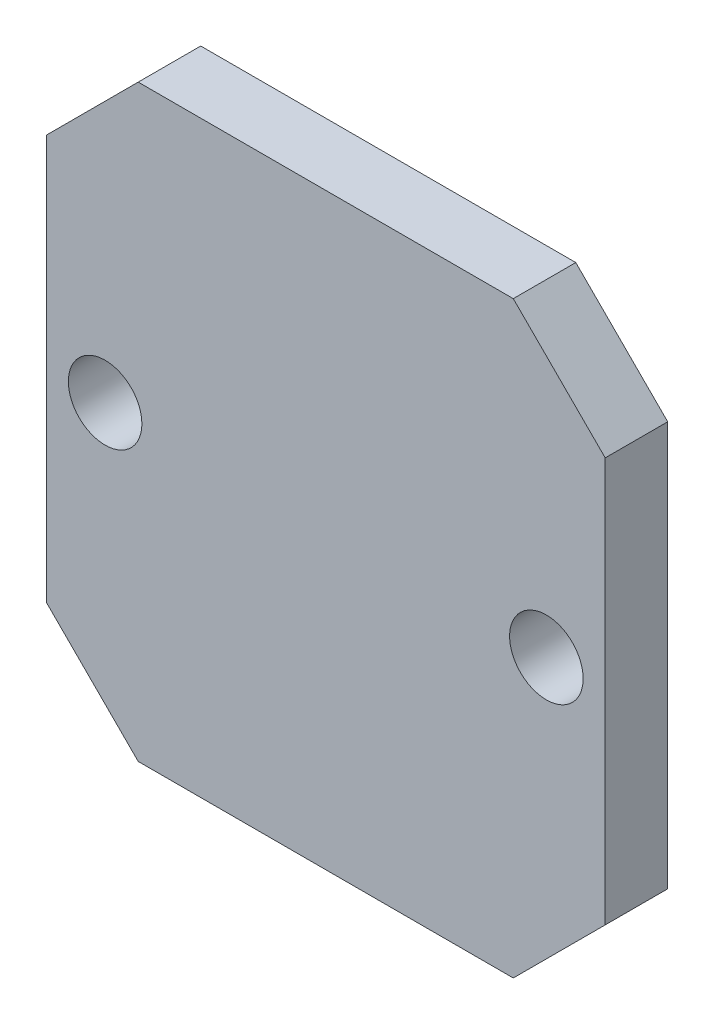
ISO-10303-21;
HEADER;
FILE_DESCRIPTION(('STEP AP214'),'2;1');
FILE_NAME('part.step','',(''),(''),'','','');
FILE_SCHEMA(('AUTOMOTIVE_DESIGN { 1 0 10303 214 1 1 1 1 }'));
ENDSEC;
DATA;
#1=APPLICATION_CONTEXT('core data for automotive mechanical design processes');
#2=APPLICATION_PROTOCOL_DEFINITION('international standard','automotive_design',2000,#1);
#3=PRODUCT_CONTEXT('',#1,'mechanical');
#4=PRODUCT('Part','Part','',(#3));
#5=PRODUCT_RELATED_PRODUCT_CATEGORY('part','',(#4));
#6=PRODUCT_DEFINITION_FORMATION('','',#4);
#7=PRODUCT_DEFINITION_CONTEXT('part definition',#1,'design');
#8=PRODUCT_DEFINITION('design','',#6,#7);
#9=PRODUCT_DEFINITION_SHAPE('','',#8);
#10=(LENGTH_UNIT() NAMED_UNIT(*) SI_UNIT(.MILLI.,.METRE.));
#11=(NAMED_UNIT(*) PLANE_ANGLE_UNIT() SI_UNIT($,.RADIAN.));
#12=(NAMED_UNIT(*) SI_UNIT($,.STERADIAN.) SOLID_ANGLE_UNIT());
#13=UNCERTAINTY_MEASURE_WITH_UNIT(LENGTH_MEASURE(1.E-05),#10,'distance_accuracy_value','');
#14=(GEOMETRIC_REPRESENTATION_CONTEXT(3) GLOBAL_UNCERTAINTY_ASSIGNED_CONTEXT((#13)) GLOBAL_UNIT_ASSIGNED_CONTEXT((#10,
#11,#12)) REPRESENTATION_CONTEXT('',''));
#15=CARTESIAN_POINT('',(0.,0.,0.));
#16=DIRECTION('',(0.,0.,1.));
#17=DIRECTION('',(1.,0.,0.));
#18=AXIS2_PLACEMENT_3D('',#15,#16,#17);
#19=CARTESIAN_POINT('',(0.,0.,1.7));
#20=DIRECTION('',(0.,0.,-1.));
#21=DIRECTION('',(-1.,0.,0.));
#22=AXIS2_PLACEMENT_3D('',#19,#20,#21);
#23=PLANE('',#22);
#24=DIRECTION('',(1.,0.,0.));
#25=VECTOR('',#24,1.);
#26=CARTESIAN_POINT('',(7.6,-8.,1.7));
#27=LINE('',#26,#25);
#28=CARTESIAN_POINT('',(-5.1,-8.,1.7));
#29=VERTEX_POINT('',#28);
#30=CARTESIAN_POINT('',(5.09999999999999,-8.,1.7));
#31=VERTEX_POINT('',#30);
#32=EDGE_CURVE('E168',#29,#31,#27,.T.);
#33=ORIENTED_EDGE('',*,*,#32,.T.);
#34=DIRECTION('',(-0.707106781186549,-0.707106781186546,0.));
#35=VECTOR('',#34,1.);
#36=CARTESIAN_POINT('',(7.6,-5.5,1.7));
#37=LINE('',#36,#35);
#38=CARTESIAN_POINT('',(7.6,-5.5,1.7));
#39=VERTEX_POINT('',#38);
#40=EDGE_CURVE('E148',#31,#39,#37,.F.);
#41=ORIENTED_EDGE('',*,*,#40,.T.);
#42=DIRECTION('',(0.,1.,0.));
#43=VECTOR('',#42,1.);
#44=CARTESIAN_POINT('',(7.6,8.,1.7));
#45=LINE('',#44,#43);
#46=CARTESIAN_POINT('',(7.6,5.49999999999999,1.7));
#47=VERTEX_POINT('',#46);
#48=EDGE_CURVE('E118',#39,#47,#45,.T.);
#49=ORIENTED_EDGE('',*,*,#48,.T.);
#50=DIRECTION('',(0.707106781186546,-0.707106781186549,0.));
#51=VECTOR('',#50,1.);
#52=CARTESIAN_POINT('',(5.1,8.,1.7));
#53=LINE('',#52,#51);
#54=CARTESIAN_POINT('',(5.1,8.,1.7));
#55=VERTEX_POINT('',#54);
#56=EDGE_CURVE('E54',#47,#55,#53,.F.);
#57=ORIENTED_EDGE('',*,*,#56,.T.);
#58=DIRECTION('',(-1.,0.,0.));
#59=VECTOR('',#58,1.);
#60=CARTESIAN_POINT('',(7.6,8.,1.7));
#61=LINE('',#60,#59);
#62=CARTESIAN_POINT('',(-5.09999999999999,8.,1.7));
#63=VERTEX_POINT('',#62);
#64=EDGE_CURVE('E135',#55,#63,#61,.T.);
#65=ORIENTED_EDGE('',*,*,#64,.T.);
#66=DIRECTION('',(0.707106781186549,0.707106781186546,0.));
#67=VECTOR('',#66,1.);
#68=CARTESIAN_POINT('',(-7.6,5.5,1.7));
#69=LINE('',#68,#67);
#70=CARTESIAN_POINT('',(-7.6,5.5,1.7));
#71=VERTEX_POINT('',#70);
#72=EDGE_CURVE('E143',#63,#71,#69,.F.);
#73=ORIENTED_EDGE('',*,*,#72,.T.);
#74=DIRECTION('',(0.,-1.,0.));
#75=VECTOR('',#74,1.);
#76=CARTESIAN_POINT('',(-7.6,8.,1.7));
#77=LINE('',#76,#75);
#78=CARTESIAN_POINT('',(-7.6,-5.49999999999999,1.7));
#79=VERTEX_POINT('',#78);
#80=EDGE_CURVE('E129',#71,#79,#77,.T.);
#81=ORIENTED_EDGE('',*,*,#80,.T.);
#82=DIRECTION('',(-0.707106781186546,0.707106781186549,0.));
#83=VECTOR('',#82,1.);
#84=CARTESIAN_POINT('',(-5.1,-8.,1.7));
#85=LINE('',#84,#83);
#86=EDGE_CURVE('E146',#79,#29,#85,.F.);
#87=ORIENTED_EDGE('',*,*,#86,.T.);
#88=EDGE_LOOP('',(#33,#41,#49,#57,#65,#73,#81,#87));
#89=FACE_BOUND('',#88,.T.);
#90=CARTESIAN_POINT('',(-6.,0.,1.7));
#91=DIRECTION('',(0.,0.,1.));
#92=DIRECTION('',(1.,0.,0.));
#93=AXIS2_PLACEMENT_3D('',#90,#91,#92);
#94=CIRCLE('',#93,1.);
#95=CARTESIAN_POINT('',(-5.,0.,1.7));
#96=VERTEX_POINT('',#95);
#97=EDGE_CURVE('E174',#96,#96,#94,.T.);
#98=ORIENTED_EDGE('',*,*,#97,.F.);
#99=EDGE_LOOP('',(#98));
#100=FACE_BOUND('',#99,.T.);
#101=CARTESIAN_POINT('',(6.,0.,1.7));
#102=DIRECTION('',(0.,0.,1.));
#103=DIRECTION('',(1.,0.,0.));
#104=AXIS2_PLACEMENT_3D('',#101,#102,#103);
#105=CIRCLE('',#104,1.);
#106=CARTESIAN_POINT('',(7.,0.,1.7));
#107=VERTEX_POINT('',#106);
#108=EDGE_CURVE('E183',#107,#107,#105,.T.);
#109=ORIENTED_EDGE('',*,*,#108,.F.);
#110=EDGE_LOOP('',(#109));
#111=FACE_BOUND('',#110,.T.);
#112=ADVANCED_FACE('F33',(#89,#100,#111),#23,.F.);
#113=CARTESIAN_POINT('',(0.,0.,0.));
#114=DIRECTION('',(0.,0.,-1.));
#115=DIRECTION('',(-1.,0.,0.));
#116=AXIS2_PLACEMENT_3D('',#113,#114,#115);
#117=PLANE('',#116);
#118=CARTESIAN_POINT('',(-6.,0.,0.));
#119=DIRECTION('',(0.,0.,1.));
#120=DIRECTION('',(1.,0.,0.));
#121=AXIS2_PLACEMENT_3D('',#118,#119,#120);
#122=CIRCLE('',#121,1.);
#123=CARTESIAN_POINT('',(-5.,0.,0.));
#124=VERTEX_POINT('',#123);
#125=EDGE_CURVE('E176',#124,#124,#122,.T.);
#126=ORIENTED_EDGE('',*,*,#125,.T.);
#127=EDGE_LOOP('',(#126));
#128=FACE_BOUND('',#127,.T.);
#129=DIRECTION('',(0.,1.,0.));
#130=VECTOR('',#129,1.);
#131=CARTESIAN_POINT('',(7.6,8.,0.));
#132=LINE('',#131,#130);
#133=CARTESIAN_POINT('',(7.6,-5.5,0.));
#134=VERTEX_POINT('',#133);
#135=CARTESIAN_POINT('',(7.6,5.49999999999999,0.));
#136=VERTEX_POINT('',#135);
#137=EDGE_CURVE('E116',#134,#136,#132,.T.);
#138=ORIENTED_EDGE('',*,*,#137,.F.);
#139=DIRECTION('',(0.707106781186549,0.707106781186546,0.));
#140=VECTOR('',#139,1.);
#141=CARTESIAN_POINT('',(6.54999999999998,-6.55000000000001,0.));
#142=LINE('',#141,#140);
#143=CARTESIAN_POINT('',(5.09999999999999,-8.,0.));
#144=VERTEX_POINT('',#143);
#145=EDGE_CURVE('E99',#134,#144,#142,.F.);
#146=ORIENTED_EDGE('',*,*,#145,.T.);
#147=DIRECTION('',(1.,0.,0.));
#148=VECTOR('',#147,1.);
#149=CARTESIAN_POINT('',(7.6,-8.,0.));
#150=LINE('',#149,#148);
#151=CARTESIAN_POINT('',(-5.1,-8.,0.));
#152=VERTEX_POINT('',#151);
#153=EDGE_CURVE('E127',#152,#144,#150,.T.);
#154=ORIENTED_EDGE('',*,*,#153,.F.);
#155=DIRECTION('',(0.707106781186546,-0.707106781186549,0.));
#156=VECTOR('',#155,1.);
#157=CARTESIAN_POINT('',(-6.55000000000001,-6.54999999999998,0.));
#158=LINE('',#157,#156);
#159=CARTESIAN_POINT('',(-7.6,-5.49999999999999,0.));
#160=VERTEX_POINT('',#159);
#161=EDGE_CURVE('E110',#152,#160,#158,.F.);
#162=ORIENTED_EDGE('',*,*,#161,.T.);
#163=DIRECTION('',(0.,-1.,0.));
#164=VECTOR('',#163,1.);
#165=CARTESIAN_POINT('',(-7.6,8.,0.));
#166=LINE('',#165,#164);
#167=CARTESIAN_POINT('',(-7.6,5.5,0.));
#168=VERTEX_POINT('',#167);
#169=EDGE_CURVE('E131',#168,#160,#166,.T.);
#170=ORIENTED_EDGE('',*,*,#169,.F.);
#171=DIRECTION('',(-0.707106781186549,-0.707106781186546,0.));
#172=VECTOR('',#171,1.);
#173=CARTESIAN_POINT('',(-6.54999999999998,6.55000000000001,0.));
#174=LINE('',#173,#172);
#175=CARTESIAN_POINT('',(-5.09999999999999,8.,0.));
#176=VERTEX_POINT('',#175);
#177=EDGE_CURVE('E119',#168,#176,#174,.F.);
#178=ORIENTED_EDGE('',*,*,#177,.T.);
#179=DIRECTION('',(-1.,0.,0.));
#180=VECTOR('',#179,1.);
#181=CARTESIAN_POINT('',(7.6,8.,0.));
#182=LINE('',#181,#180);
#183=CARTESIAN_POINT('',(5.1,8.,0.));
#184=VERTEX_POINT('',#183);
#185=EDGE_CURVE('E126',#184,#176,#182,.T.);
#186=ORIENTED_EDGE('',*,*,#185,.F.);
#187=DIRECTION('',(-0.707106781186546,0.707106781186549,0.));
#188=VECTOR('',#187,1.);
#189=CARTESIAN_POINT('',(6.55000000000001,6.54999999999998,0.));
#190=LINE('',#189,#188);
#191=EDGE_CURVE('E125',#184,#136,#190,.F.);
#192=ORIENTED_EDGE('',*,*,#191,.T.);
#193=EDGE_LOOP('',(#138,#146,#154,#162,#170,#178,#186,#192));
#194=FACE_BOUND('',#193,.T.);
#195=CARTESIAN_POINT('',(6.,0.,0.));
#196=DIRECTION('',(0.,0.,1.));
#197=DIRECTION('',(1.,0.,0.));
#198=AXIS2_PLACEMENT_3D('',#195,#196,#197);
#199=CIRCLE('',#198,1.);
#200=CARTESIAN_POINT('',(7.,0.,0.));
#201=VERTEX_POINT('',#200);
#202=EDGE_CURVE('E185',#201,#201,#199,.T.);
#203=ORIENTED_EDGE('',*,*,#202,.T.);
#204=EDGE_LOOP('',(#203));
#205=FACE_BOUND('',#204,.T.);
#206=ADVANCED_FACE('F122',(#128,#194,#205),#117,.T.);
#207=CARTESIAN_POINT('',(-7.6,8.,1.7));
#208=DIRECTION('',(1.,0.,0.));
#209=DIRECTION('',(0.,1.,0.));
#210=AXIS2_PLACEMENT_3D('',#207,#208,#209);
#211=PLANE('',#210);
#212=ORIENTED_EDGE('',*,*,#169,.T.);
#213=DIRECTION('',(0.,0.,1.));
#214=VECTOR('',#213,1.);
#215=CARTESIAN_POINT('',(-7.6,-5.49999999999999,1.7));
#216=LINE('',#215,#214);
#217=EDGE_CURVE('E153',#160,#79,#216,.T.);
#218=ORIENTED_EDGE('',*,*,#217,.T.);
#219=ORIENTED_EDGE('',*,*,#80,.F.);
#220=DIRECTION('',(0.,0.,-1.));
#221=VECTOR('',#220,1.);
#222=CARTESIAN_POINT('',(-7.6,5.5,1.7));
#223=LINE('',#222,#221);
#224=EDGE_CURVE('E150',#71,#168,#223,.T.);
#225=ORIENTED_EDGE('',*,*,#224,.T.);
#226=EDGE_LOOP('',(#212,#218,#219,#225));
#227=FACE_BOUND('',#226,.T.);
#228=ADVANCED_FACE('F159',(#227),#211,.F.);
#229=CARTESIAN_POINT('',(7.6,-8.,1.7));
#230=DIRECTION('',(0.,1.,0.));
#231=DIRECTION('',(-1.,0.,0.));
#232=AXIS2_PLACEMENT_3D('',#229,#230,#231);
#233=PLANE('',#232);
#234=ORIENTED_EDGE('',*,*,#153,.T.);
#235=DIRECTION('',(0.,0.,1.));
#236=VECTOR('',#235,1.);
#237=CARTESIAN_POINT('',(5.09999999999999,-8.,1.7));
#238=LINE('',#237,#236);
#239=EDGE_CURVE('E104',#144,#31,#238,.T.);
#240=ORIENTED_EDGE('',*,*,#239,.T.);
#241=ORIENTED_EDGE('',*,*,#32,.F.);
#242=DIRECTION('',(0.,0.,-1.));
#243=VECTOR('',#242,1.);
#244=CARTESIAN_POINT('',(-5.1,-8.,1.7));
#245=LINE('',#244,#243);
#246=EDGE_CURVE('E109',#29,#152,#245,.T.);
#247=ORIENTED_EDGE('',*,*,#246,.T.);
#248=EDGE_LOOP('',(#234,#240,#241,#247));
#249=FACE_BOUND('',#248,.T.);
#250=ADVANCED_FACE('F173',(#249),#233,.F.);
#251=CARTESIAN_POINT('',(7.6,8.,1.7));
#252=DIRECTION('',(-1.,0.,0.));
#253=DIRECTION('',(0.,-1.,0.));
#254=AXIS2_PLACEMENT_3D('',#251,#252,#253);
#255=PLANE('',#254);
#256=ORIENTED_EDGE('',*,*,#48,.F.);
#257=DIRECTION('',(0.,0.,-1.));
#258=VECTOR('',#257,1.);
#259=CARTESIAN_POINT('',(7.6,-5.5,1.7));
#260=LINE('',#259,#258);
#261=EDGE_CURVE('E103',#39,#134,#260,.T.);
#262=ORIENTED_EDGE('',*,*,#261,.T.);
#263=ORIENTED_EDGE('',*,*,#137,.T.);
#264=DIRECTION('',(0.,0.,1.));
#265=VECTOR('',#264,1.);
#266=CARTESIAN_POINT('',(7.6,5.49999999999999,1.7));
#267=LINE('',#266,#265);
#268=EDGE_CURVE('E120',#136,#47,#267,.T.);
#269=ORIENTED_EDGE('',*,*,#268,.T.);
#270=EDGE_LOOP('',(#256,#262,#263,#269));
#271=FACE_BOUND('',#270,.T.);
#272=ADVANCED_FACE('F115',(#271),#255,.F.);
#273=CARTESIAN_POINT('',(7.6,8.,1.7));
#274=DIRECTION('',(0.,-1.,0.));
#275=DIRECTION('',(1.,0.,0.));
#276=AXIS2_PLACEMENT_3D('',#273,#274,#275);
#277=PLANE('',#276);
#278=ORIENTED_EDGE('',*,*,#64,.F.);
#279=DIRECTION('',(0.,0.,-1.));
#280=VECTOR('',#279,1.);
#281=CARTESIAN_POINT('',(5.1,8.,1.7));
#282=LINE('',#281,#280);
#283=EDGE_CURVE('E11',#55,#184,#282,.T.);
#284=ORIENTED_EDGE('',*,*,#283,.T.);
#285=ORIENTED_EDGE('',*,*,#185,.T.);
#286=DIRECTION('',(0.,0.,1.));
#287=VECTOR('',#286,1.);
#288=CARTESIAN_POINT('',(-5.09999999999999,8.,1.7));
#289=LINE('',#288,#287);
#290=EDGE_CURVE('E41',#176,#63,#289,.T.);
#291=ORIENTED_EDGE('',*,*,#290,.T.);
#292=EDGE_LOOP('',(#278,#284,#285,#291));
#293=FACE_BOUND('',#292,.T.);
#294=ADVANCED_FACE('F205',(#293),#277,.F.);
#295=CARTESIAN_POINT('',(-6.,0.,1.7));
#296=DIRECTION('',(0.,0.,-1.));
#297=DIRECTION('',(-1.,0.,0.));
#298=AXIS2_PLACEMENT_3D('',#295,#296,#297);
#299=CYLINDRICAL_SURFACE('',#298,1.);
#300=ORIENTED_EDGE('',*,*,#97,.T.);
#301=EDGE_LOOP('',(#300));
#302=FACE_BOUND('',#301,.T.);
#303=ORIENTED_EDGE('',*,*,#125,.F.);
#304=EDGE_LOOP('',(#303));
#305=FACE_BOUND('',#304,.T.);
#306=ADVANCED_FACE('F202',(#302,#305),#299,.F.);
#307=CARTESIAN_POINT('',(6.,0.,1.7));
#308=DIRECTION('',(0.,0.,-1.));
#309=DIRECTION('',(-1.,0.,0.));
#310=AXIS2_PLACEMENT_3D('',#307,#308,#309);
#311=CYLINDRICAL_SURFACE('',#310,1.);
#312=ORIENTED_EDGE('',*,*,#108,.T.);
#313=EDGE_LOOP('',(#312));
#314=FACE_BOUND('',#313,.T.);
#315=ORIENTED_EDGE('',*,*,#202,.F.);
#316=EDGE_LOOP('',(#315));
#317=FACE_BOUND('',#316,.T.);
#318=ADVANCED_FACE('F191',(#314,#317),#311,.F.);
#319=CARTESIAN_POINT('',(7.6,-5.5,1.7));
#320=DIRECTION('',(-0.707106781186546,0.707106781186549,0.));
#321=DIRECTION('',(0.,0.,-1.));
#322=AXIS2_PLACEMENT_3D('',#319,#320,#321);
#323=PLANE('',#322);
#324=ORIENTED_EDGE('',*,*,#40,.F.);
#325=ORIENTED_EDGE('',*,*,#239,.F.);
#326=ORIENTED_EDGE('',*,*,#145,.F.);
#327=ORIENTED_EDGE('',*,*,#261,.F.);
#328=EDGE_LOOP('',(#324,#325,#326,#327));
#329=FACE_BOUND('',#328,.T.);
#330=ADVANCED_FACE('F102',(#329),#323,.F.);
#331=CARTESIAN_POINT('',(-5.1,-8.,1.7));
#332=DIRECTION('',(0.707106781186549,0.707106781186546,0.));
#333=DIRECTION('',(0.,0.,-1.));
#334=AXIS2_PLACEMENT_3D('',#331,#332,#333);
#335=PLANE('',#334);
#336=ORIENTED_EDGE('',*,*,#86,.F.);
#337=ORIENTED_EDGE('',*,*,#217,.F.);
#338=ORIENTED_EDGE('',*,*,#161,.F.);
#339=ORIENTED_EDGE('',*,*,#246,.F.);
#340=EDGE_LOOP('',(#336,#337,#338,#339));
#341=FACE_BOUND('',#340,.T.);
#342=ADVANCED_FACE('F171',(#341),#335,.F.);
#343=CARTESIAN_POINT('',(5.1,8.,1.7));
#344=DIRECTION('',(-0.707106781186549,-0.707106781186546,0.));
#345=DIRECTION('',(0.,0.,-1.));
#346=AXIS2_PLACEMENT_3D('',#343,#344,#345);
#347=PLANE('',#346);
#348=ORIENTED_EDGE('',*,*,#56,.F.);
#349=ORIENTED_EDGE('',*,*,#268,.F.);
#350=ORIENTED_EDGE('',*,*,#191,.F.);
#351=ORIENTED_EDGE('',*,*,#283,.F.);
#352=EDGE_LOOP('',(#348,#349,#350,#351));
#353=FACE_BOUND('',#352,.T.);
#354=ADVANCED_FACE('F217',(#353),#347,.F.);
#355=CARTESIAN_POINT('',(-7.6,5.5,1.7));
#356=DIRECTION('',(0.707106781186546,-0.707106781186549,0.));
#357=DIRECTION('',(0.,0.,-1.));
#358=AXIS2_PLACEMENT_3D('',#355,#356,#357);
#359=PLANE('',#358);
#360=ORIENTED_EDGE('',*,*,#72,.F.);
#361=ORIENTED_EDGE('',*,*,#290,.F.);
#362=ORIENTED_EDGE('',*,*,#177,.F.);
#363=ORIENTED_EDGE('',*,*,#224,.F.);
#364=EDGE_LOOP('',(#360,#361,#362,#363));
#365=FACE_BOUND('',#364,.T.);
#366=ADVANCED_FACE('F35',(#365),#359,.F.);
#367=CLOSED_SHELL('',(#112,#206,#228,#250,#272,#294,#306,#318,#330,#342,#354,#366));
#368=MANIFOLD_SOLID_BREP('B2',#367);
#369=ADVANCED_BREP_SHAPE_REPRESENTATION('',(#18,#368),#14);
#370=SHAPE_DEFINITION_REPRESENTATION(#9,#369);
ENDSEC;
END-ISO-10303-21;
